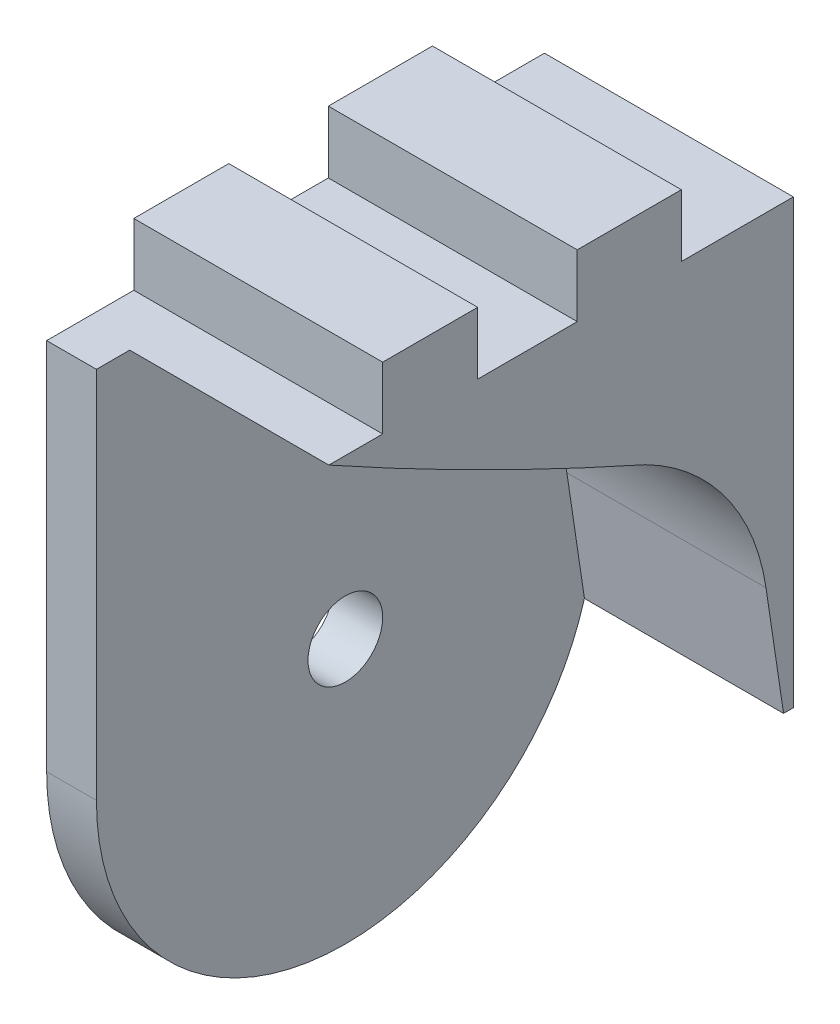
ISO-10303-21;
HEADER;
FILE_DESCRIPTION(('STEP AP214'),'2;1');
FILE_NAME('part.step','',(''),(''),'','','');
FILE_SCHEMA(('AUTOMOTIVE_DESIGN { 1 0 10303 214 1 1 1 1 }'));
ENDSEC;
DATA;
#1=APPLICATION_CONTEXT('core data for automotive mechanical design processes');
#2=APPLICATION_PROTOCOL_DEFINITION('international standard','automotive_design',2000,#1);
#3=PRODUCT_CONTEXT('',#1,'mechanical');
#4=PRODUCT('Part','Part','',(#3));
#5=PRODUCT_RELATED_PRODUCT_CATEGORY('part','',(#4));
#6=PRODUCT_DEFINITION_FORMATION('','',#4);
#7=PRODUCT_DEFINITION_CONTEXT('part definition',#1,'design');
#8=PRODUCT_DEFINITION('design','',#6,#7);
#9=PRODUCT_DEFINITION_SHAPE('','',#8);
#10=(LENGTH_UNIT() NAMED_UNIT(*) SI_UNIT(.MILLI.,.METRE.));
#11=(NAMED_UNIT(*) PLANE_ANGLE_UNIT() SI_UNIT($,.RADIAN.));
#12=(NAMED_UNIT(*) SI_UNIT($,.STERADIAN.) SOLID_ANGLE_UNIT());
#13=UNCERTAINTY_MEASURE_WITH_UNIT(LENGTH_MEASURE(1.E-05),#10,'distance_accuracy_value','');
#14=(GEOMETRIC_REPRESENTATION_CONTEXT(3) GLOBAL_UNCERTAINTY_ASSIGNED_CONTEXT((#13)) GLOBAL_UNIT_ASSIGNED_CONTEXT((#10,
#11,#12)) REPRESENTATION_CONTEXT('',''));
#15=CARTESIAN_POINT('',(0.,0.,0.));
#16=DIRECTION('',(0.,0.,1.));
#17=DIRECTION('',(1.,0.,0.));
#18=AXIS2_PLACEMENT_3D('',#15,#16,#17);
#19=CARTESIAN_POINT('',(-4.,55.,40.));
#20=DIRECTION('',(0.,-1.,0.));
#21=DIRECTION('',(1.,0.,0.));
#22=AXIS2_PLACEMENT_3D('',#19,#20,#21);
#23=PLANE('',#22);
#24=DIRECTION('',(0.,0.,-1.));
#25=VECTOR('',#24,1.);
#26=CARTESIAN_POINT('',(-4.,55.,40.));
#27=LINE('',#26,#25);
#28=CARTESIAN_POINT('',(-4.,55.,33.));
#29=VERTEX_POINT('',#28);
#30=CARTESIAN_POINT('',(-4.,55.,25.3660375931076));
#31=VERTEX_POINT('',#30);
#32=EDGE_CURVE('E280',#29,#31,#27,.T.);
#33=ORIENTED_EDGE('',*,*,#32,.F.);
#34=DIRECTION('',(-1.,0.,0.));
#35=VECTOR('',#34,1.);
#36=CARTESIAN_POINT('',(16.,55.,33.));
#37=LINE('',#36,#35);
#38=CARTESIAN_POINT('',(16.,55.,33.));
#39=VERTEX_POINT('',#38);
#40=EDGE_CURVE('E217',#39,#29,#37,.T.);
#41=ORIENTED_EDGE('',*,*,#40,.F.);
#42=DIRECTION('',(0.,0.,-1.));
#43=VECTOR('',#42,1.);
#44=CARTESIAN_POINT('',(16.,55.,40.));
#45=LINE('',#44,#43);
#46=CARTESIAN_POINT('',(16.,55.,25.3660375931076));
#47=VERTEX_POINT('',#46);
#48=EDGE_CURVE('E283',#39,#47,#45,.T.);
#49=ORIENTED_EDGE('',*,*,#48,.T.);
#50=DIRECTION('',(-1.,0.,0.));
#51=VECTOR('',#50,1.);
#52=CARTESIAN_POINT('',(16.,55.,25.3660375931076));
#53=LINE('',#52,#51);
#54=EDGE_CURVE('E219',#47,#31,#53,.T.);
#55=ORIENTED_EDGE('',*,*,#54,.T.);
#56=EDGE_LOOP('',(#33,#41,#49,#55));
#57=FACE_BOUND('',#56,.T.);
#58=ADVANCED_FACE('F36',(#57),#23,.F.);
#59=CARTESIAN_POINT('',(0.,0.,40.));
#60=DIRECTION('',(-1.,0.,0.));
#61=DIRECTION('',(0.,0.,1.));
#62=AXIS2_PLACEMENT_3D('',#59,#60,#61);
#63=PLANE('',#62);
#64=CARTESIAN_POINT('',(0.,21.2375980792143,20.));
#65=DIRECTION('',(-1.,0.,0.));
#66=DIRECTION('',(0.,0.,1.));
#67=AXIS2_PLACEMENT_3D('',#64,#65,#66);
#68=CIRCLE('',#67,3.);
#69=CARTESIAN_POINT('',(0.,21.2375980792143,23.));
#70=VERTEX_POINT('',#69);
#71=EDGE_CURVE('E234',#70,#70,#68,.T.);
#72=ORIENTED_EDGE('',*,*,#71,.T.);
#73=EDGE_LOOP('',(#72));
#74=FACE_BOUND('',#73,.T.);
#75=CARTESIAN_POINT('',(0.,335.816317486461,-121.193092553436));
#76=DIRECTION('',(-1.,0.,0.));
#77=DIRECTION('',(0.,0.,1.));
#78=AXIS2_PLACEMENT_3D('',#75,#76,#77);
#79=CIRCLE('',#78,326.831732663771);
#80=CARTESIAN_POINT('',(0.,50.,37.3250897931997));
#81=VERTEX_POINT('',#80);
#82=CARTESIAN_POINT('',(0.,37.3056268301771,11.8871427931811));
#83=VERTEX_POINT('',#82);
#84=EDGE_CURVE('E264',#81,#83,#79,.F.);
#85=ORIENTED_EDGE('',*,*,#84,.F.);
#86=DIRECTION('',(0.,0.,1.));
#87=VECTOR('',#86,1.);
#88=CARTESIAN_POINT('',(0.,50.,40.0000000000001));
#89=LINE('',#88,#87);
#90=CARTESIAN_POINT('',(0.,50.,40.));
#91=VERTEX_POINT('',#90);
#92=EDGE_CURVE('E214',#81,#91,#89,.T.);
#93=ORIENTED_EDGE('',*,*,#92,.T.);
#94=DIRECTION('',(0.,1.,0.));
#95=VECTOR('',#94,1.);
#96=CARTESIAN_POINT('',(0.,0.,40.));
#97=LINE('',#96,#95);
#98=CARTESIAN_POINT('',(0.,20.,40.));
#99=VERTEX_POINT('',#98);
#100=EDGE_CURVE('E269',#99,#91,#97,.T.);
#101=ORIENTED_EDGE('',*,*,#100,.F.);
#102=CARTESIAN_POINT('',(0.,20.,20.));
#103=DIRECTION('',(-1.,0.,0.));
#104=DIRECTION('',(0.,0.,1.));
#105=AXIS2_PLACEMENT_3D('',#102,#103,#104);
#106=CIRCLE('',#105,20.);
#107=CARTESIAN_POINT('',(0.,0.,20.));
#108=VERTEX_POINT('',#107);
#109=EDGE_CURVE('E284',#99,#108,#106,.F.);
#110=ORIENTED_EDGE('',*,*,#109,.T.);
#111=CARTESIAN_POINT('',(0.,20.,20.));
#112=DIRECTION('',(-1.,0.,0.));
#113=DIRECTION('',(0.,0.,1.));
#114=AXIS2_PLACEMENT_3D('',#111,#112,#113);
#115=CIRCLE('',#114,20.);
#116=CARTESIAN_POINT('',(0.,14.4473036085163,0.786266297671242));
#117=VERTEX_POINT('',#116);
#118=EDGE_CURVE('E286',#108,#117,#115,.F.);
#119=ORIENTED_EDGE('',*,*,#118,.T.);
#120=DIRECTION('',(0.,0.989031049423699,0.147707763085953));
#121=VECTOR('',#120,1.);
#122=CARTESIAN_POINT('',(0.,6.04384407887813,-0.468756191288486));
#123=LINE('',#122,#121);
#124=CARTESIAN_POINT('',(0.,23.8963378147614,2.19744111037341));
#125=VERTEX_POINT('',#124);
#126=EDGE_CURVE('E253',#117,#125,#123,.T.);
#127=ORIENTED_EDGE('',*,*,#126,.T.);
#128=CARTESIAN_POINT('',(0.,21.2375980792143,20.));
#129=DIRECTION('',(-1.,0.,0.));
#130=DIRECTION('',(0.,0.,1.));
#131=AXIS2_PLACEMENT_3D('',#128,#129,#130);
#132=CIRCLE('',#131,18.);
#133=EDGE_CURVE('E266',#83,#125,#132,.T.);
#134=ORIENTED_EDGE('',*,*,#133,.F.);
#135=EDGE_LOOP('',(#85,#93,#101,#110,#119,#127,#134));
#136=FACE_BOUND('',#135,.T.);
#137=ADVANCED_FACE('F320',(#74,#136),#63,.F.);
#138=CARTESIAN_POINT('',(16.,55.,40.));
#139=DIRECTION('',(-1.,0.,0.));
#140=DIRECTION('',(0.,0.,1.));
#141=AXIS2_PLACEMENT_3D('',#138,#139,#140);
#142=PLANE('',#141);
#143=DIRECTION('',(0.,-1.,0.));
#144=VECTOR('',#143,1.);
#145=CARTESIAN_POINT('',(16.,55.,33.));
#146=LINE('',#145,#144);
#147=CARTESIAN_POINT('',(16.,50.,33.));
#148=VERTEX_POINT('',#147);
#149=EDGE_CURVE('E194',#39,#148,#146,.T.);
#150=ORIENTED_EDGE('',*,*,#149,.T.);
#151=DIRECTION('',(0.,0.,1.));
#152=VECTOR('',#151,1.);
#153=CARTESIAN_POINT('',(16.,50.,33.));
#154=LINE('',#153,#152);
#155=CARTESIAN_POINT('',(16.,50.0000000000002,37.3250897931997));
#156=VERTEX_POINT('',#155);
#157=EDGE_CURVE('E196',#148,#156,#154,.T.);
#158=ORIENTED_EDGE('',*,*,#157,.T.);
#159=CARTESIAN_POINT('',(16.,335.816317486461,-121.193092553436));
#160=DIRECTION('',(-1.,0.,0.));
#161=DIRECTION('',(0.,0.,1.));
#162=AXIS2_PLACEMENT_3D('',#159,#160,#161);
#163=CIRCLE('',#162,326.831732663771);
#164=CARTESIAN_POINT('',(16.,37.3056268301771,11.8871427931811));
#165=VERTEX_POINT('',#164);
#166=EDGE_CURVE('E246',#156,#165,#163,.F.);
#167=ORIENTED_EDGE('',*,*,#166,.T.);
#168=CARTESIAN_POINT('',(16.,21.2375980792143,20.));
#169=DIRECTION('',(-1.,0.,0.));
#170=DIRECTION('',(0.,0.,1.));
#171=AXIS2_PLACEMENT_3D('',#168,#169,#170);
#172=CIRCLE('',#171,18.);
#173=CARTESIAN_POINT('',(16.,23.8963378147614,2.19744111037341));
#174=VERTEX_POINT('',#173);
#175=EDGE_CURVE('E244',#165,#174,#172,.T.);
#176=ORIENTED_EDGE('',*,*,#175,.T.);
#177=DIRECTION('',(0.,0.989031049423699,0.147707763085953));
#178=VECTOR('',#177,1.);
#179=CARTESIAN_POINT('',(16.,0.200341521561027,-1.34145952232274));
#180=LINE('',#179,#178);
#181=CARTESIAN_POINT('',(16.,14.4473036085163,0.786266297671242));
#182=VERTEX_POINT('',#181);
#183=EDGE_CURVE('E241',#182,#174,#180,.T.);
#184=ORIENTED_EDGE('',*,*,#183,.F.);
#185=DIRECTION('',(0.,0.,1.));
#186=VECTOR('',#185,1.);
#187=CARTESIAN_POINT('',(16.,14.4473036085163,0.));
#188=LINE('',#187,#186);
#189=CARTESIAN_POINT('',(16.,14.4473036085163,0.));
#190=VERTEX_POINT('',#189);
#191=EDGE_CURVE('E238',#190,#182,#188,.T.);
#192=ORIENTED_EDGE('',*,*,#191,.F.);
#193=DIRECTION('',(0.,1.,0.));
#194=VECTOR('',#193,1.);
#195=CARTESIAN_POINT('',(16.,55.,0.));
#196=LINE('',#195,#194);
#197=CARTESIAN_POINT('',(16.,50.,0.));
#198=VERTEX_POINT('',#197);
#199=EDGE_CURVE('E180',#190,#198,#196,.T.);
#200=ORIENTED_EDGE('',*,*,#199,.T.);
#201=DIRECTION('',(0.,0.,1.));
#202=VECTOR('',#201,1.);
#203=CARTESIAN_POINT('',(16.,50.,0.));
#204=LINE('',#203,#202);
#205=CARTESIAN_POINT('',(16.,50.,9.00000000000001));
#206=VERTEX_POINT('',#205);
#207=EDGE_CURVE('E59',#198,#206,#204,.T.);
#208=ORIENTED_EDGE('',*,*,#207,.T.);
#209=DIRECTION('',(0.,1.,0.));
#210=VECTOR('',#209,1.);
#211=CARTESIAN_POINT('',(16.,50.,9.00000000000001));
#212=LINE('',#211,#210);
#213=CARTESIAN_POINT('',(16.,55.,9.));
#214=VERTEX_POINT('',#213);
#215=EDGE_CURVE('E168',#206,#214,#212,.T.);
#216=ORIENTED_EDGE('',*,*,#215,.T.);
#217=CARTESIAN_POINT('',(16.,55.,17.3660375931076));
#218=VERTEX_POINT('',#217);
#219=EDGE_CURVE('E281',#218,#214,#45,.T.);
#220=ORIENTED_EDGE('',*,*,#219,.F.);
#221=DIRECTION('',(0.,-1.,0.));
#222=VECTOR('',#221,1.);
#223=CARTESIAN_POINT('',(16.,55.,17.3660375931076));
#224=LINE('',#223,#222);
#225=CARTESIAN_POINT('',(16.,50.,17.3660375931076));
#226=VERTEX_POINT('',#225);
#227=EDGE_CURVE('E174',#218,#226,#224,.T.);
#228=ORIENTED_EDGE('',*,*,#227,.T.);
#229=DIRECTION('',(0.,0.,1.));
#230=VECTOR('',#229,1.);
#231=CARTESIAN_POINT('',(16.,50.,17.3660375931076));
#232=LINE('',#231,#230);
#233=CARTESIAN_POINT('',(16.,50.,25.3660375931076));
#234=VERTEX_POINT('',#233);
#235=EDGE_CURVE('E188',#226,#234,#232,.T.);
#236=ORIENTED_EDGE('',*,*,#235,.T.);
#237=DIRECTION('',(0.,1.,0.));
#238=VECTOR('',#237,1.);
#239=CARTESIAN_POINT('',(16.,50.,25.3660375931076));
#240=LINE('',#239,#238);
#241=EDGE_CURVE('E191',#234,#47,#240,.T.);
#242=ORIENTED_EDGE('',*,*,#241,.T.);
#243=ORIENTED_EDGE('',*,*,#48,.F.);
#244=EDGE_LOOP('',(#150,#158,#167,#176,#184,#192,#200,#208,#216,#220,#228,#236,#242,#243));
#245=FACE_BOUND('',#244,.T.);
#246=ADVANCED_FACE('F178',(#245),#142,.F.);
#247=CARTESIAN_POINT('',(-4.,55.,17.3660375931076));
#248=VERTEX_POINT('',#247);
#249=CARTESIAN_POINT('',(-4.,55.,9.));
#250=VERTEX_POINT('',#249);
#251=EDGE_CURVE('E275',#248,#250,#27,.T.);
#252=ORIENTED_EDGE('',*,*,#251,.F.);
#253=DIRECTION('',(-1.,0.,0.));
#254=VECTOR('',#253,1.);
#255=CARTESIAN_POINT('',(16.,55.,17.3660375931076));
#256=LINE('',#255,#254);
#257=EDGE_CURVE('E51',#218,#248,#256,.T.);
#258=ORIENTED_EDGE('',*,*,#257,.F.);
#259=ORIENTED_EDGE('',*,*,#219,.T.);
#260=DIRECTION('',(-1.,0.,0.));
#261=VECTOR('',#260,1.);
#262=CARTESIAN_POINT('',(16.,55.,9.));
#263=LINE('',#262,#261);
#264=EDGE_CURVE('E164',#214,#250,#263,.T.);
#265=ORIENTED_EDGE('',*,*,#264,.T.);
#266=EDGE_LOOP('',(#252,#258,#259,#265));
#267=FACE_BOUND('',#266,.T.);
#268=ADVANCED_FACE('F352',(#267),#23,.F.);
#269=CARTESIAN_POINT('',(-4.,0.,40.));
#270=DIRECTION('',(1.,0.,0.));
#271=DIRECTION('',(0.,0.,-1.));
#272=AXIS2_PLACEMENT_3D('',#269,#270,#271);
#273=PLANE('',#272);
#274=CARTESIAN_POINT('',(-4.,21.2375980792143,20.));
#275=DIRECTION('',(-1.,0.,0.));
#276=DIRECTION('',(0.,0.,1.));
#277=AXIS2_PLACEMENT_3D('',#274,#275,#276);
#278=CIRCLE('',#277,3.);
#279=CARTESIAN_POINT('',(-4.,21.2375980792143,23.));
#280=VERTEX_POINT('',#279);
#281=EDGE_CURVE('E231',#280,#280,#278,.T.);
#282=ORIENTED_EDGE('',*,*,#281,.F.);
#283=EDGE_LOOP('',(#282));
#284=FACE_BOUND('',#283,.T.);
#285=DIRECTION('',(0.,-1.,0.));
#286=VECTOR('',#285,1.);
#287=CARTESIAN_POINT('',(-4.,0.,40.));
#288=LINE('',#287,#286);
#289=CARTESIAN_POINT('',(-4.,50.,40.));
#290=VERTEX_POINT('',#289);
#291=CARTESIAN_POINT('',(-4.,20.,40.));
#292=VERTEX_POINT('',#291);
#293=EDGE_CURVE('E272',#290,#292,#288,.T.);
#294=ORIENTED_EDGE('',*,*,#293,.F.);
#295=DIRECTION('',(0.,0.,1.));
#296=VECTOR('',#295,1.);
#297=CARTESIAN_POINT('',(-4.,50.,33.));
#298=LINE('',#297,#296);
#299=CARTESIAN_POINT('',(-4.,50.,33.));
#300=VERTEX_POINT('',#299);
#301=EDGE_CURVE('E181',#300,#290,#298,.T.);
#302=ORIENTED_EDGE('',*,*,#301,.F.);
#303=DIRECTION('',(0.,-1.,0.));
#304=VECTOR('',#303,1.);
#305=CARTESIAN_POINT('',(-4.,55.,33.));
#306=LINE('',#305,#304);
#307=EDGE_CURVE('E183',#29,#300,#306,.T.);
#308=ORIENTED_EDGE('',*,*,#307,.F.);
#309=ORIENTED_EDGE('',*,*,#32,.T.);
#310=DIRECTION('',(0.,1.,0.));
#311=VECTOR('',#310,1.);
#312=CARTESIAN_POINT('',(-4.,50.,25.3660375931076));
#313=LINE('',#312,#311);
#314=CARTESIAN_POINT('',(-4.,50.,25.3660375931076));
#315=VERTEX_POINT('',#314);
#316=EDGE_CURVE('E207',#315,#31,#313,.T.);
#317=ORIENTED_EDGE('',*,*,#316,.F.);
#318=DIRECTION('',(0.,0.,1.));
#319=VECTOR('',#318,1.);
#320=CARTESIAN_POINT('',(-4.,50.,17.3660375931076));
#321=LINE('',#320,#319);
#322=CARTESIAN_POINT('',(-4.,50.,17.3660375931076));
#323=VERTEX_POINT('',#322);
#324=EDGE_CURVE('E204',#323,#315,#321,.T.);
#325=ORIENTED_EDGE('',*,*,#324,.F.);
#326=DIRECTION('',(0.,-1.,0.));
#327=VECTOR('',#326,1.);
#328=CARTESIAN_POINT('',(-4.,55.,17.3660375931076));
#329=LINE('',#328,#327);
#330=EDGE_CURVE('E202',#248,#323,#329,.T.);
#331=ORIENTED_EDGE('',*,*,#330,.F.);
#332=ORIENTED_EDGE('',*,*,#251,.T.);
#333=DIRECTION('',(0.,1.,0.));
#334=VECTOR('',#333,1.);
#335=CARTESIAN_POINT('',(-4.,50.,9.00000000000001));
#336=LINE('',#335,#334);
#337=CARTESIAN_POINT('',(-4.,50.,9.00000000000001));
#338=VERTEX_POINT('',#337);
#339=EDGE_CURVE('E200',#338,#250,#336,.T.);
#340=ORIENTED_EDGE('',*,*,#339,.F.);
#341=DIRECTION('',(0.,0.,1.));
#342=VECTOR('',#341,1.);
#343=CARTESIAN_POINT('',(-4.,50.,0.));
#344=LINE('',#343,#342);
#345=CARTESIAN_POINT('',(-4.,50.,0.));
#346=VERTEX_POINT('',#345);
#347=EDGE_CURVE('E161',#346,#338,#344,.T.);
#348=ORIENTED_EDGE('',*,*,#347,.F.);
#349=DIRECTION('',(0.,-1.,0.));
#350=VECTOR('',#349,1.);
#351=CARTESIAN_POINT('',(-4.,0.,0.));
#352=LINE('',#351,#350);
#353=CARTESIAN_POINT('',(-4.,14.4473036085163,0.));
#354=VERTEX_POINT('',#353);
#355=EDGE_CURVE('E273',#346,#354,#352,.T.);
#356=ORIENTED_EDGE('',*,*,#355,.T.);
#357=DIRECTION('',(0.,0.,1.));
#358=VECTOR('',#357,1.);
#359=CARTESIAN_POINT('',(-4.,14.4473036085163,0.));
#360=LINE('',#359,#358);
#361=CARTESIAN_POINT('',(-4.,14.4473036085163,0.786266297671243));
#362=VERTEX_POINT('',#361);
#363=EDGE_CURVE('E237',#354,#362,#360,.T.);
#364=ORIENTED_EDGE('',*,*,#363,.T.);
#365=CARTESIAN_POINT('',(-4.,20.,20.));
#366=DIRECTION('',(1.,0.,0.));
#367=DIRECTION('',(0.,0.,-1.));
#368=AXIS2_PLACEMENT_3D('',#365,#366,#367);
#369=CIRCLE('',#368,20.);
#370=CARTESIAN_POINT('',(-4.,0.,20.));
#371=VERTEX_POINT('',#370);
#372=EDGE_CURVE('E292',#362,#371,#369,.F.);
#373=ORIENTED_EDGE('',*,*,#372,.T.);
#374=CARTESIAN_POINT('',(-4.,20.,20.));
#375=DIRECTION('',(1.,0.,0.));
#376=DIRECTION('',(0.,0.,-1.));
#377=AXIS2_PLACEMENT_3D('',#374,#375,#376);
#378=CIRCLE('',#377,20.);
#379=EDGE_CURVE('E289',#371,#292,#378,.F.);
#380=ORIENTED_EDGE('',*,*,#379,.T.);
#381=EDGE_LOOP('',(#294,#302,#308,#309,#317,#325,#331,#332,#340,#348,#356,#364,#373,#380));
#382=FACE_BOUND('',#381,.T.);
#383=ADVANCED_FACE('F311',(#284,#382),#273,.F.);
#384=CARTESIAN_POINT('',(0.,0.,40.));
#385=DIRECTION('',(0.,0.,-1.));
#386=DIRECTION('',(-1.,0.,0.));
#387=AXIS2_PLACEMENT_3D('',#384,#385,#386);
#388=PLANE('',#387);
#389=ORIENTED_EDGE('',*,*,#100,.T.);
#390=DIRECTION('',(-1.,0.,0.));
#391=VECTOR('',#390,1.);
#392=CARTESIAN_POINT('',(16.,50.,40.));
#393=LINE('',#392,#391);
#394=EDGE_CURVE('E211',#91,#290,#393,.T.);
#395=ORIENTED_EDGE('',*,*,#394,.T.);
#396=ORIENTED_EDGE('',*,*,#293,.T.);
#397=DIRECTION('',(1.,0.,0.));
#398=VECTOR('',#397,1.);
#399=CARTESIAN_POINT('',(0.,20.,40.));
#400=LINE('',#399,#398);
#401=EDGE_CURVE('E294',#292,#99,#400,.T.);
#402=ORIENTED_EDGE('',*,*,#401,.T.);
#403=EDGE_LOOP('',(#389,#395,#396,#402));
#404=FACE_BOUND('',#403,.T.);
#405=ADVANCED_FACE('F317',(#404),#388,.F.);
#406=CARTESIAN_POINT('',(0.,0.,0.));
#407=DIRECTION('',(0.,0.,-1.));
#408=DIRECTION('',(-1.,0.,0.));
#409=AXIS2_PLACEMENT_3D('',#406,#407,#408);
#410=PLANE('',#409);
#411=DIRECTION('',(-1.,0.,0.));
#412=VECTOR('',#411,1.);
#413=CARTESIAN_POINT('',(16.,50.,0.));
#414=LINE('',#413,#412);
#415=EDGE_CURVE('E165',#198,#346,#414,.T.);
#416=ORIENTED_EDGE('',*,*,#415,.F.);
#417=ORIENTED_EDGE('',*,*,#199,.F.);
#418=DIRECTION('',(-1.,0.,0.));
#419=VECTOR('',#418,1.);
#420=CARTESIAN_POINT('',(16.,14.4473036085163,0.));
#421=LINE('',#420,#419);
#422=EDGE_CURVE('E248',#190,#354,#421,.T.);
#423=ORIENTED_EDGE('',*,*,#422,.T.);
#424=ORIENTED_EDGE('',*,*,#355,.F.);
#425=EDGE_LOOP('',(#416,#417,#423,#424));
#426=FACE_BOUND('',#425,.T.);
#427=ADVANCED_FACE('F378',(#426),#410,.T.);
#428=CARTESIAN_POINT('',(0.,20.,20.));
#429=DIRECTION('',(1.,0.,0.));
#430=DIRECTION('',(0.,1.,0.));
#431=AXIS2_PLACEMENT_3D('',#428,#429,#430);
#432=CYLINDRICAL_SURFACE('',#431,20.);
#433=ORIENTED_EDGE('',*,*,#401,.F.);
#434=ORIENTED_EDGE('',*,*,#379,.F.);
#435=DIRECTION('',(1.,0.,0.));
#436=VECTOR('',#435,1.);
#437=CARTESIAN_POINT('',(0.,0.,20.));
#438=LINE('',#437,#436);
#439=EDGE_CURVE('E268',#108,#371,#438,.F.);
#440=ORIENTED_EDGE('',*,*,#439,.F.);
#441=ORIENTED_EDGE('',*,*,#109,.F.);
#442=EDGE_LOOP('',(#433,#434,#440,#441));
#443=FACE_BOUND('',#442,.T.);
#444=ADVANCED_FACE('F38',(#443),#432,.T.);
#445=CARTESIAN_POINT('',(0.,20.,20.));
#446=DIRECTION('',(-1.,0.,0.));
#447=DIRECTION('',(0.,-1.,0.));
#448=AXIS2_PLACEMENT_3D('',#445,#446,#447);
#449=CYLINDRICAL_SURFACE('',#448,20.);
#450=DIRECTION('',(-1.,0.,0.));
#451=VECTOR('',#450,1.);
#452=CARTESIAN_POINT('',(0.,14.4473036085163,0.786266297671246));
#453=LINE('',#452,#451);
#454=EDGE_CURVE('E44',#117,#362,#453,.T.);
#455=ORIENTED_EDGE('',*,*,#454,.F.);
#456=ORIENTED_EDGE('',*,*,#118,.F.);
#457=ORIENTED_EDGE('',*,*,#439,.T.);
#458=ORIENTED_EDGE('',*,*,#372,.F.);
#459=EDGE_LOOP('',(#455,#456,#457,#458));
#460=FACE_BOUND('',#459,.T.);
#461=ADVANCED_FACE('F306',(#460),#449,.T.);
#462=CARTESIAN_POINT('',(16.,21.2375980792143,20.));
#463=DIRECTION('',(-1.,0.,0.));
#464=DIRECTION('',(0.,0.,1.));
#465=AXIS2_PLACEMENT_3D('',#462,#463,#464);
#466=CYLINDRICAL_SURFACE('',#465,18.);
#467=DIRECTION('',(-1.,0.,0.));
#468=VECTOR('',#467,1.);
#469=CARTESIAN_POINT('',(16.,37.3056268301771,11.8871427931811));
#470=LINE('',#469,#468);
#471=EDGE_CURVE('E250',#165,#83,#470,.T.);
#472=ORIENTED_EDGE('',*,*,#471,.T.);
#473=ORIENTED_EDGE('',*,*,#133,.T.);
#474=DIRECTION('',(-1.,0.,0.));
#475=VECTOR('',#474,1.);
#476=CARTESIAN_POINT('',(16.,23.8963378147614,2.19744111037341));
#477=LINE('',#476,#475);
#478=EDGE_CURVE('E254',#174,#125,#477,.T.);
#479=ORIENTED_EDGE('',*,*,#478,.F.);
#480=ORIENTED_EDGE('',*,*,#175,.F.);
#481=EDGE_LOOP('',(#472,#473,#479,#480));
#482=FACE_BOUND('',#481,.T.);
#483=ADVANCED_FACE('F371',(#482),#466,.F.);
#484=CARTESIAN_POINT('',(16.,335.816317486461,-121.193092553436));
#485=DIRECTION('',(-1.,0.,0.));
#486=DIRECTION('',(0.,0.,1.));
#487=AXIS2_PLACEMENT_3D('',#484,#485,#486);
#488=CYLINDRICAL_SURFACE('',#487,326.831732663771);
#489=ORIENTED_EDGE('',*,*,#166,.F.);
#490=DIRECTION('',(-1.,0.,0.));
#491=VECTOR('',#490,1.);
#492=CARTESIAN_POINT('',(16.,50.0000000000001,37.3250897931997));
#493=LINE('',#492,#491);
#494=EDGE_CURVE('E11',#156,#81,#493,.T.);
#495=ORIENTED_EDGE('',*,*,#494,.T.);
#496=ORIENTED_EDGE('',*,*,#84,.T.);
#497=ORIENTED_EDGE('',*,*,#471,.F.);
#498=EDGE_LOOP('',(#489,#495,#496,#497));
#499=FACE_BOUND('',#498,.T.);
#500=ADVANCED_FACE('F327',(#499),#488,.T.);
#501=CARTESIAN_POINT('',(16.,0.200341521561027,-1.34145952232274));
#502=DIRECTION('',(0.,-0.147707763085953,0.989031049423699));
#503=DIRECTION('',(0.,-0.989031049423699,-0.147707763085953));
#504=AXIS2_PLACEMENT_3D('',#501,#502,#503);
#505=PLANE('',#504);
#506=ORIENTED_EDGE('',*,*,#126,.F.);
#507=DIRECTION('',(-1.,0.,0.));
#508=VECTOR('',#507,1.);
#509=CARTESIAN_POINT('',(16.,14.4473036085163,0.786266297671242));
#510=LINE('',#509,#508);
#511=EDGE_CURVE('E257',#182,#117,#510,.T.);
#512=ORIENTED_EDGE('',*,*,#511,.F.);
#513=ORIENTED_EDGE('',*,*,#183,.T.);
#514=ORIENTED_EDGE('',*,*,#478,.T.);
#515=EDGE_LOOP('',(#506,#512,#513,#514));
#516=FACE_BOUND('',#515,.T.);
#517=ADVANCED_FACE('F392',(#516),#505,.T.);
#518=CARTESIAN_POINT('',(16.,14.4473036085163,0.));
#519=DIRECTION('',(0.,-1.,0.));
#520=DIRECTION('',(0.,0.,-1.));
#521=AXIS2_PLACEMENT_3D('',#518,#519,#520);
#522=PLANE('',#521);
#523=ORIENTED_EDGE('',*,*,#363,.F.);
#524=ORIENTED_EDGE('',*,*,#422,.F.);
#525=ORIENTED_EDGE('',*,*,#191,.T.);
#526=ORIENTED_EDGE('',*,*,#511,.T.);
#527=ORIENTED_EDGE('',*,*,#454,.T.);
#528=EDGE_LOOP('',(#523,#524,#525,#526,#527));
#529=FACE_BOUND('',#528,.T.);
#530=ADVANCED_FACE('F302',(#529),#522,.T.);
#531=CARTESIAN_POINT('',(6.,21.2375980792143,20.));
#532=DIRECTION('',(-1.,0.,0.));
#533=DIRECTION('',(0.,0.,1.));
#534=AXIS2_PLACEMENT_3D('',#531,#532,#533);
#535=CYLINDRICAL_SURFACE('',#534,3.);
#536=ORIENTED_EDGE('',*,*,#281,.T.);
#537=EDGE_LOOP('',(#536));
#538=FACE_BOUND('',#537,.T.);
#539=ORIENTED_EDGE('',*,*,#71,.F.);
#540=EDGE_LOOP('',(#539));
#541=FACE_BOUND('',#540,.T.);
#542=ADVANCED_FACE('F391',(#538,#541),#535,.F.);
#543=CARTESIAN_POINT('',(16.,50.,33.));
#544=DIRECTION('',(0.,-1.,0.));
#545=DIRECTION('',(0.,0.,-1.));
#546=AXIS2_PLACEMENT_3D('',#543,#544,#545);
#547=PLANE('',#546);
#548=ORIENTED_EDGE('',*,*,#494,.F.);
#549=ORIENTED_EDGE('',*,*,#157,.F.);
#550=DIRECTION('',(-1.,0.,0.));
#551=VECTOR('',#550,1.);
#552=CARTESIAN_POINT('',(16.,50.,33.));
#553=LINE('',#552,#551);
#554=EDGE_CURVE('E215',#148,#300,#553,.T.);
#555=ORIENTED_EDGE('',*,*,#554,.T.);
#556=ORIENTED_EDGE('',*,*,#301,.T.);
#557=ORIENTED_EDGE('',*,*,#394,.F.);
#558=ORIENTED_EDGE('',*,*,#92,.F.);
#559=EDGE_LOOP('',(#548,#549,#555,#556,#557,#558));
#560=FACE_BOUND('',#559,.T.);
#561=ADVANCED_FACE('F323',(#560),#547,.F.);
#562=CARTESIAN_POINT('',(16.,55.,33.));
#563=DIRECTION('',(0.,0.,-1.));
#564=DIRECTION('',(-1.,0.,0.));
#565=AXIS2_PLACEMENT_3D('',#562,#563,#564);
#566=PLANE('',#565);
#567=ORIENTED_EDGE('',*,*,#307,.T.);
#568=ORIENTED_EDGE('',*,*,#554,.F.);
#569=ORIENTED_EDGE('',*,*,#149,.F.);
#570=ORIENTED_EDGE('',*,*,#40,.T.);
#571=EDGE_LOOP('',(#567,#568,#569,#570));
#572=FACE_BOUND('',#571,.T.);
#573=ADVANCED_FACE('F336',(#572),#566,.F.);
#574=CARTESIAN_POINT('',(16.,50.,0.));
#575=DIRECTION('',(0.,-1.,0.));
#576=DIRECTION('',(0.,0.,-1.));
#577=AXIS2_PLACEMENT_3D('',#574,#575,#576);
#578=PLANE('',#577);
#579=ORIENTED_EDGE('',*,*,#347,.T.);
#580=DIRECTION('',(-1.,0.,0.));
#581=VECTOR('',#580,1.);
#582=CARTESIAN_POINT('',(16.,50.,9.00000000000001));
#583=LINE('',#582,#581);
#584=EDGE_CURVE('E157',#206,#338,#583,.T.);
#585=ORIENTED_EDGE('',*,*,#584,.F.);
#586=ORIENTED_EDGE('',*,*,#207,.F.);
#587=ORIENTED_EDGE('',*,*,#415,.T.);
#588=EDGE_LOOP('',(#579,#585,#586,#587));
#589=FACE_BOUND('',#588,.T.);
#590=ADVANCED_FACE('F159',(#589),#578,.F.);
#591=CARTESIAN_POINT('',(16.,50.,9.00000000000001));
#592=DIRECTION('',(0.,0.,1.));
#593=DIRECTION('',(0.,-1.,0.));
#594=AXIS2_PLACEMENT_3D('',#591,#592,#593);
#595=PLANE('',#594);
#596=ORIENTED_EDGE('',*,*,#339,.T.);
#597=ORIENTED_EDGE('',*,*,#264,.F.);
#598=ORIENTED_EDGE('',*,*,#215,.F.);
#599=ORIENTED_EDGE('',*,*,#584,.T.);
#600=EDGE_LOOP('',(#596,#597,#598,#599));
#601=FACE_BOUND('',#600,.T.);
#602=ADVANCED_FACE('F169',(#601),#595,.F.);
#603=CARTESIAN_POINT('',(16.,50.,25.3660375931076));
#604=DIRECTION('',(0.,0.,1.));
#605=DIRECTION('',(1.,0.,0.));
#606=AXIS2_PLACEMENT_3D('',#603,#604,#605);
#607=PLANE('',#606);
#608=ORIENTED_EDGE('',*,*,#316,.T.);
#609=ORIENTED_EDGE('',*,*,#54,.F.);
#610=ORIENTED_EDGE('',*,*,#241,.F.);
#611=DIRECTION('',(-1.,0.,0.));
#612=VECTOR('',#611,1.);
#613=CARTESIAN_POINT('',(16.,50.,25.3660375931076));
#614=LINE('',#613,#612);
#615=EDGE_CURVE('E222',#234,#315,#614,.T.);
#616=ORIENTED_EDGE('',*,*,#615,.T.);
#617=EDGE_LOOP('',(#608,#609,#610,#616));
#618=FACE_BOUND('',#617,.T.);
#619=ADVANCED_FACE('F345',(#618),#607,.F.);
#620=CARTESIAN_POINT('',(16.,50.,17.3660375931076));
#621=DIRECTION('',(0.,-1.,0.));
#622=DIRECTION('',(0.,0.,-1.));
#623=AXIS2_PLACEMENT_3D('',#620,#621,#622);
#624=PLANE('',#623);
#625=ORIENTED_EDGE('',*,*,#324,.T.);
#626=ORIENTED_EDGE('',*,*,#615,.F.);
#627=ORIENTED_EDGE('',*,*,#235,.F.);
#628=DIRECTION('',(-1.,0.,0.));
#629=VECTOR('',#628,1.);
#630=CARTESIAN_POINT('',(16.,50.,17.3660375931076));
#631=LINE('',#630,#629);
#632=EDGE_CURVE('E224',#226,#323,#631,.T.);
#633=ORIENTED_EDGE('',*,*,#632,.T.);
#634=EDGE_LOOP('',(#625,#626,#627,#633));
#635=FACE_BOUND('',#634,.T.);
#636=ADVANCED_FACE('F348',(#635),#624,.F.);
#637=CARTESIAN_POINT('',(16.,55.,17.3660375931076));
#638=DIRECTION('',(0.,0.,-1.));
#639=DIRECTION('',(-1.,0.,0.));
#640=AXIS2_PLACEMENT_3D('',#637,#638,#639);
#641=PLANE('',#640);
#642=ORIENTED_EDGE('',*,*,#330,.T.);
#643=ORIENTED_EDGE('',*,*,#632,.F.);
#644=ORIENTED_EDGE('',*,*,#227,.F.);
#645=ORIENTED_EDGE('',*,*,#257,.T.);
#646=EDGE_LOOP('',(#642,#643,#644,#645));
#647=FACE_BOUND('',#646,.T.);
#648=ADVANCED_FACE('F405',(#647),#641,.F.);
#649=CLOSED_SHELL('',(#58,#137,#246,#268,#383,#405,#427,#444,#461,#483,#500,#517,#530,#542,#561,
#573,#590,#602,#619,#636,#648));
#650=MANIFOLD_SOLID_BREP('B2',#649);
#651=ADVANCED_BREP_SHAPE_REPRESENTATION('',(#18,#650),#14);
#652=SHAPE_DEFINITION_REPRESENTATION(#9,#651);
ENDSEC;
END-ISO-10303-21;
